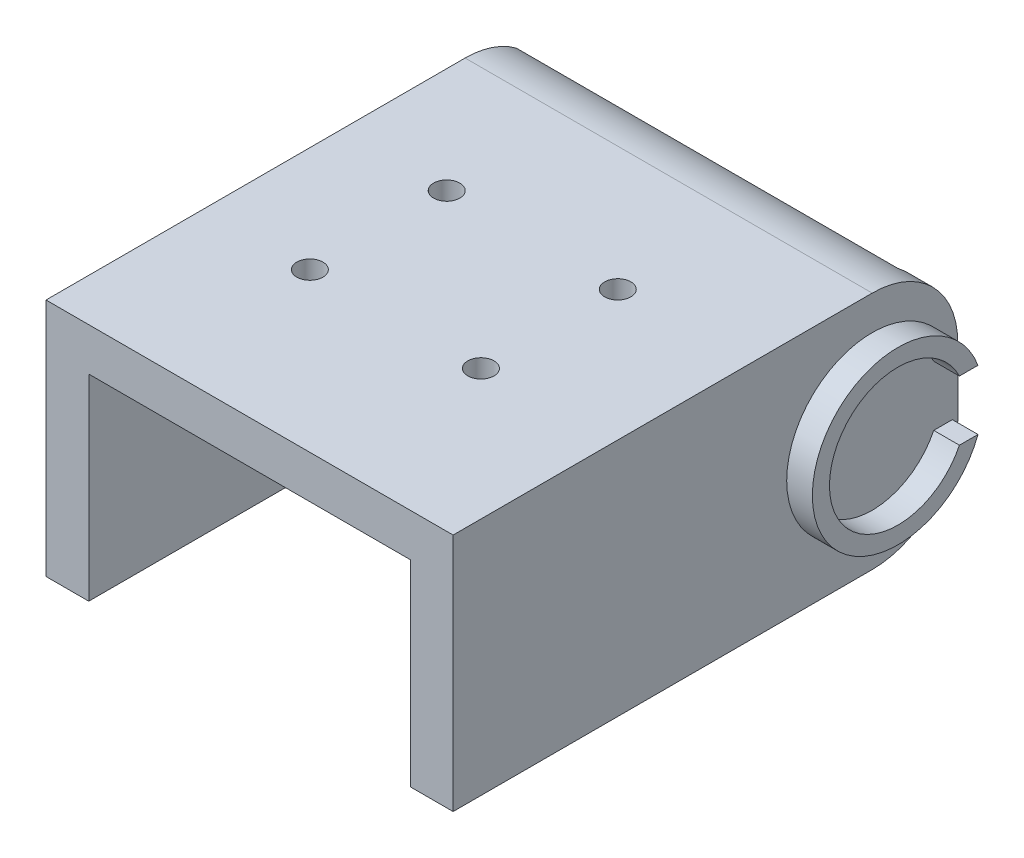
ISO-10303-21;
HEADER;
FILE_DESCRIPTION(('STEP AP214'),'2;1');
FILE_NAME('part.step','',(''),(''),'','','');
FILE_SCHEMA(('AUTOMOTIVE_DESIGN { 1 0 10303 214 1 1 1 1 }'));
ENDSEC;
DATA;
#1=APPLICATION_CONTEXT('core data for automotive mechanical design processes');
#2=APPLICATION_PROTOCOL_DEFINITION('international standard','automotive_design',2000,#1);
#3=PRODUCT_CONTEXT('',#1,'mechanical');
#4=PRODUCT('Part','Part','',(#3));
#5=PRODUCT_RELATED_PRODUCT_CATEGORY('part','',(#4));
#6=PRODUCT_DEFINITION_FORMATION('','',#4);
#7=PRODUCT_DEFINITION_CONTEXT('part definition',#1,'design');
#8=PRODUCT_DEFINITION('design','',#6,#7);
#9=PRODUCT_DEFINITION_SHAPE('','',#8);
#10=(LENGTH_UNIT() NAMED_UNIT(*) SI_UNIT(.MILLI.,.METRE.));
#11=(NAMED_UNIT(*) PLANE_ANGLE_UNIT() SI_UNIT($,.RADIAN.));
#12=(NAMED_UNIT(*) SI_UNIT($,.STERADIAN.) SOLID_ANGLE_UNIT());
#13=UNCERTAINTY_MEASURE_WITH_UNIT(LENGTH_MEASURE(1.E-05),#10,'distance_accuracy_value','');
#14=(GEOMETRIC_REPRESENTATION_CONTEXT(3) GLOBAL_UNCERTAINTY_ASSIGNED_CONTEXT((#13)) GLOBAL_UNIT_ASSIGNED_CONTEXT((#10,
#11,#12)) REPRESENTATION_CONTEXT('',''));
#15=CARTESIAN_POINT('',(0.,0.,0.));
#16=DIRECTION('',(0.,0.,1.));
#17=DIRECTION('',(1.,0.,0.));
#18=AXIS2_PLACEMENT_3D('',#15,#16,#17);
#19=CARTESIAN_POINT('',(67.6,0.,0.));
#20=DIRECTION('',(0.,0.,1.));
#21=DIRECTION('',(-1.,0.,0.));
#22=AXIS2_PLACEMENT_3D('',#19,#20,#21);
#23=PLANE('',#22);
#24=DIRECTION('',(0.,1.,0.));
#25=VECTOR('',#24,1.);
#26=CARTESIAN_POINT('',(40.8,0.,0.));
#27=LINE('',#26,#25);
#28=CARTESIAN_POINT('',(40.8,-4.,0.));
#29=VERTEX_POINT('',#28);
#30=CARTESIAN_POINT('',(40.8,-3.49999999999999,0.));
#31=VERTEX_POINT('',#30);
#32=EDGE_CURVE('E384',#29,#31,#27,.T.);
#33=ORIENTED_EDGE('',*,*,#32,.T.);
#34=DIRECTION('',(1.,0.,0.));
#35=VECTOR('',#34,1.);
#36=CARTESIAN_POINT('',(40.8,-3.49999999999999,0.));
#37=LINE('',#36,#35);
#38=CARTESIAN_POINT('',(43.8,-3.49999999999999,0.));
#39=VERTEX_POINT('',#38);
#40=EDGE_CURVE('E447',#31,#39,#37,.T.);
#41=ORIENTED_EDGE('',*,*,#40,.T.);
#42=DIRECTION('',(0.,1.,0.));
#43=VECTOR('',#42,1.);
#44=CARTESIAN_POINT('',(43.8,14.,0.));
#45=LINE('',#44,#43);
#46=CARTESIAN_POINT('',(43.8,3.50000000000001,0.));
#47=VERTEX_POINT('',#46);
#48=EDGE_CURVE('E503',#39,#47,#45,.T.);
#49=ORIENTED_EDGE('',*,*,#48,.T.);
#50=DIRECTION('',(1.,0.,0.));
#51=VECTOR('',#50,1.);
#52=CARTESIAN_POINT('',(40.8,3.50000000000001,0.));
#53=LINE('',#52,#51);
#54=CARTESIAN_POINT('',(40.8,3.50000000000001,0.));
#55=VERTEX_POINT('',#54);
#56=EDGE_CURVE('E437',#55,#47,#53,.T.);
#57=ORIENTED_EDGE('',*,*,#56,.F.);
#58=DIRECTION('',(0.,1.,0.));
#59=VECTOR('',#58,1.);
#60=CARTESIAN_POINT('',(40.8,0.,0.));
#61=LINE('',#60,#59);
#62=CARTESIAN_POINT('',(40.8,8.00000000000001,0.));
#63=VERTEX_POINT('',#62);
#64=EDGE_CURVE('E398',#55,#63,#61,.T.);
#65=ORIENTED_EDGE('',*,*,#64,.T.);
#66=DIRECTION('',(1.,0.,0.));
#67=VECTOR('',#66,1.);
#68=CARTESIAN_POINT('',(40.8,8.00000000000001,0.));
#69=LINE('',#68,#67);
#70=CARTESIAN_POINT('',(43.8,8.00000000000001,0.));
#71=VERTEX_POINT('',#70);
#72=EDGE_CURVE('E433',#63,#71,#69,.T.);
#73=ORIENTED_EDGE('',*,*,#72,.T.);
#74=CARTESIAN_POINT('',(43.8,12.,0.));
#75=VERTEX_POINT('',#74);
#76=EDGE_CURVE('E494',#71,#75,#45,.T.);
#77=ORIENTED_EDGE('',*,*,#76,.T.);
#78=DIRECTION('',(-1.,0.,0.));
#79=VECTOR('',#78,1.);
#80=CARTESIAN_POINT('',(88.4,12.,0.));
#81=LINE('',#80,#79);
#82=CARTESIAN_POINT('',(88.4,12.,0.));
#83=VERTEX_POINT('',#82);
#84=EDGE_CURVE('E550',#83,#75,#81,.T.);
#85=ORIENTED_EDGE('',*,*,#84,.F.);
#86=DIRECTION('',(0.,-1.,0.));
#87=VECTOR('',#86,1.);
#88=CARTESIAN_POINT('',(88.4,14.,0.));
#89=LINE('',#88,#87);
#90=CARTESIAN_POINT('',(88.4,-3.99999999999998,0.));
#91=VERTEX_POINT('',#90);
#92=EDGE_CURVE('E320',#83,#91,#89,.T.);
#93=ORIENTED_EDGE('',*,*,#92,.T.);
#94=DIRECTION('',(-1.,0.,0.));
#95=VECTOR('',#94,1.);
#96=CARTESIAN_POINT('',(67.6,-3.99999999999998,0.));
#97=LINE('',#96,#95);
#98=EDGE_CURVE('E554',#29,#91,#97,.F.);
#99=ORIENTED_EDGE('',*,*,#98,.F.);
#100=EDGE_LOOP('',(#33,#41,#49,#57,#65,#73,#77,#85,#93,#99));
#101=FACE_BOUND('',#100,.T.);
#102=ADVANCED_FACE('F49',(#101),#23,.F.);
#103=CARTESIAN_POINT('',(43.8,14.,55.));
#104=DIRECTION('',(1.,0.,0.));
#105=DIRECTION('',(0.,-1.,0.));
#106=AXIS2_PLACEMENT_3D('',#103,#104,#105);
#107=PLANE('',#106);
#108=CARTESIAN_POINT('',(43.8,0.,6.));
#109=DIRECTION('',(1.,0.,0.));
#110=DIRECTION('',(0.,1.,0.));
#111=AXIS2_PLACEMENT_3D('',#108,#109,#110);
#112=CIRCLE('',#111,2.);
#113=CARTESIAN_POINT('',(43.8,2.00000000000001,6.));
#114=VERTEX_POINT('',#113);
#115=EDGE_CURVE('E489',#114,#114,#112,.T.);
#116=ORIENTED_EDGE('',*,*,#115,.T.);
#117=EDGE_LOOP('',(#116));
#118=FACE_BOUND('',#117,.T.);
#119=CARTESIAN_POINT('',(43.8,0.,6.));
#120=DIRECTION('',(1.,0.,0.));
#121=DIRECTION('',(0.,1.,0.));
#122=AXIS2_PLACEMENT_3D('',#119,#120,#121);
#123=CIRCLE('',#122,6.65);
#124=CARTESIAN_POINT('',(43.8,3.50000000000001,0.345576952508767));
#125=VERTEX_POINT('',#124);
#126=CARTESIAN_POINT('',(43.8,-3.49999999999999,0.34557695250877));
#127=VERTEX_POINT('',#126);
#128=EDGE_CURVE('E415',#125,#127,#123,.T.);
#129=ORIENTED_EDGE('',*,*,#128,.F.);
#130=DIRECTION('',(0.,0.,-1.));
#131=VECTOR('',#130,1.);
#132=CARTESIAN_POINT('',(43.8,3.50000000000001,0.));
#133=LINE('',#132,#131);
#134=EDGE_CURVE('E419',#125,#47,#133,.T.);
#135=ORIENTED_EDGE('',*,*,#134,.T.);
#136=ORIENTED_EDGE('',*,*,#48,.F.);
#137=DIRECTION('',(0.,0.,-1.));
#138=VECTOR('',#137,1.);
#139=CARTESIAN_POINT('',(43.8,-3.49999999999999,0.));
#140=LINE('',#139,#138);
#141=EDGE_CURVE('E412',#127,#39,#140,.T.);
#142=ORIENTED_EDGE('',*,*,#141,.F.);
#143=EDGE_LOOP('',(#129,#135,#136,#142));
#144=FACE_BOUND('',#143,.T.);
#145=ADVANCED_FACE('F691',(#118,#144),#107,.F.);
#146=DIRECTION('',(0.,0.,-1.));
#147=VECTOR('',#146,1.);
#148=CARTESIAN_POINT('',(43.8,-14.,55.));
#149=LINE('',#148,#147);
#150=CARTESIAN_POINT('',(43.8,-14.,19.6013578747392));
#151=VERTEX_POINT('',#150);
#152=CARTESIAN_POINT('',(43.8,-14.,10.));
#153=VERTEX_POINT('',#152);
#154=EDGE_CURVE('E514',#151,#153,#149,.T.);
#155=ORIENTED_EDGE('',*,*,#154,.F.);
#156=DIRECTION('',(0.,1.,0.));
#157=VECTOR('',#156,1.);
#158=CARTESIAN_POINT('',(43.8,-14.,19.6013578747392));
#159=LINE('',#158,#157);
#160=CARTESIAN_POINT('',(43.8,-5.53669618417802,19.6013578747392));
#161=VERTEX_POINT('',#160);
#162=EDGE_CURVE('E471',#151,#161,#159,.T.);
#163=ORIENTED_EDGE('',*,*,#162,.T.);
#164=DIRECTION('',(0.,0.,1.));
#165=VECTOR('',#164,1.);
#166=CARTESIAN_POINT('',(43.8,-5.53669618417802,37.7174277893702));
#167=LINE('',#166,#165);
#168=CARTESIAN_POINT('',(43.8,-5.53669618417802,37.7174277893702));
#169=VERTEX_POINT('',#168);
#170=EDGE_CURVE('E456',#161,#169,#167,.T.);
#171=ORIENTED_EDGE('',*,*,#170,.T.);
#172=DIRECTION('',(0.,-1.,0.));
#173=VECTOR('',#172,1.);
#174=CARTESIAN_POINT('',(43.8,-14.,37.7174277893702));
#175=LINE('',#174,#173);
#176=CARTESIAN_POINT('',(43.8,-14.,37.7174277893702));
#177=VERTEX_POINT('',#176);
#178=EDGE_CURVE('E451',#169,#177,#175,.T.);
#179=ORIENTED_EDGE('',*,*,#178,.T.);
#180=CARTESIAN_POINT('',(43.8,-14.,55.));
#181=VERTEX_POINT('',#180);
#182=EDGE_CURVE('E518',#181,#177,#149,.T.);
#183=ORIENTED_EDGE('',*,*,#182,.F.);
#184=DIRECTION('',(0.,1.,0.));
#185=VECTOR('',#184,1.);
#186=CARTESIAN_POINT('',(43.8,14.,55.));
#187=LINE('',#186,#185);
#188=CARTESIAN_POINT('',(43.8,14.,55.));
#189=VERTEX_POINT('',#188);
#190=EDGE_CURVE('E498',#181,#189,#187,.T.);
#191=ORIENTED_EDGE('',*,*,#190,.T.);
#192=DIRECTION('',(0.,0.,-1.));
#193=VECTOR('',#192,1.);
#194=CARTESIAN_POINT('',(43.8,14.,55.));
#195=LINE('',#194,#193);
#196=CARTESIAN_POINT('',(43.8,14.,6.));
#197=VERTEX_POINT('',#196);
#198=EDGE_CURVE('E364',#189,#197,#195,.T.);
#199=ORIENTED_EDGE('',*,*,#198,.T.);
#200=CARTESIAN_POINT('',(43.8,4.,6.));
#201=DIRECTION('',(-1.,0.,0.));
#202=DIRECTION('',(0.,-1.,0.));
#203=AXIS2_PLACEMENT_3D('',#200,#201,#202);
#204=CIRCLE('',#203,10.);
#205=EDGE_CURVE('E535',#75,#197,#204,.F.);
#206=ORIENTED_EDGE('',*,*,#205,.F.);
#207=ORIENTED_EDGE('',*,*,#76,.F.);
#208=DIRECTION('',(0.,0.,-1.));
#209=VECTOR('',#208,1.);
#210=CARTESIAN_POINT('',(43.8,8.00000000000001,0.));
#211=LINE('',#210,#209);
#212=CARTESIAN_POINT('',(43.8,8.00000000000001,6.));
#213=VERTEX_POINT('',#212);
#214=EDGE_CURVE('E422',#213,#71,#211,.T.);
#215=ORIENTED_EDGE('',*,*,#214,.F.);
#216=CARTESIAN_POINT('',(43.8,0.,6.));
#217=DIRECTION('',(1.,0.,0.));
#218=DIRECTION('',(0.,1.,0.));
#219=AXIS2_PLACEMENT_3D('',#216,#217,#218);
#220=CIRCLE('',#219,8.);
#221=CARTESIAN_POINT('',(43.8,-7.99999999999999,6.));
#222=VERTEX_POINT('',#221);
#223=EDGE_CURVE('E385',#213,#222,#220,.T.);
#224=ORIENTED_EDGE('',*,*,#223,.T.);
#225=DIRECTION('',(0.,0.,-1.));
#226=VECTOR('',#225,1.);
#227=CARTESIAN_POINT('',(43.8,-7.99999999999999,0.));
#228=LINE('',#227,#226);
#229=CARTESIAN_POINT('',(43.8,-7.99999999999999,0.834848610088319));
#230=VERTEX_POINT('',#229);
#231=EDGE_CURVE('E379',#222,#230,#228,.T.);
#232=ORIENTED_EDGE('',*,*,#231,.T.);
#233=CARTESIAN_POINT('',(43.8,-4.,10.));
#234=DIRECTION('',(-1.,0.,0.));
#235=DIRECTION('',(0.,-1.,0.));
#236=AXIS2_PLACEMENT_3D('',#233,#234,#235);
#237=CIRCLE('',#236,10.);
#238=EDGE_CURVE('E539',#153,#230,#237,.F.);
#239=ORIENTED_EDGE('',*,*,#238,.F.);
#240=EDGE_LOOP('',(#155,#163,#171,#179,#183,#191,#199,#206,#207,#215,#224,#232,#239));
#241=FACE_BOUND('',#240,.T.);
#242=ADVANCED_FACE('F623',(#241),#107,.F.);
#243=CARTESIAN_POINT('',(91.4,14.,55.));
#244=DIRECTION('',(0.,-1.,0.));
#245=DIRECTION('',(0.,0.,-1.));
#246=AXIS2_PLACEMENT_3D('',#243,#244,#245);
#247=PLANE('',#246);
#248=CARTESIAN_POINT('',(76.1499999999999,14.,36.5));
#249=DIRECTION('',(0.,-1.,0.));
#250=DIRECTION('',(0.,0.,1.));
#251=AXIS2_PLACEMENT_3D('',#248,#249,#250);
#252=CIRCLE('',#251,1.53015016707913);
#253=CARTESIAN_POINT('',(76.1499999999999,14.,38.0301501670791));
#254=VERTEX_POINT('',#253);
#255=EDGE_CURVE('E304',#254,#254,#252,.T.);
#256=ORIENTED_EDGE('',*,*,#255,.T.);
#257=EDGE_LOOP('',(#256));
#258=FACE_BOUND('',#257,.T.);
#259=CARTESIAN_POINT('',(56.1499999999998,14.,36.5));
#260=DIRECTION('',(0.,-1.,0.));
#261=DIRECTION('',(0.,0.,1.));
#262=AXIS2_PLACEMENT_3D('',#259,#260,#261);
#263=CIRCLE('',#262,1.53015016707913);
#264=CARTESIAN_POINT('',(56.1499999999998,14.,38.0301501670791));
#265=VERTEX_POINT('',#264);
#266=EDGE_CURVE('E310',#265,#265,#263,.T.);
#267=ORIENTED_EDGE('',*,*,#266,.T.);
#268=EDGE_LOOP('',(#267));
#269=FACE_BOUND('',#268,.T.);
#270=CARTESIAN_POINT('',(56.15,14.,20.5));
#271=DIRECTION('',(0.,-1.,0.));
#272=DIRECTION('',(0.,0.,1.));
#273=AXIS2_PLACEMENT_3D('',#270,#271,#272);
#274=CIRCLE('',#273,1.53015016707913);
#275=CARTESIAN_POINT('',(56.15,14.,22.0301501670791));
#276=VERTEX_POINT('',#275);
#277=EDGE_CURVE('E305',#276,#276,#274,.T.);
#278=ORIENTED_EDGE('',*,*,#277,.T.);
#279=EDGE_LOOP('',(#278));
#280=FACE_BOUND('',#279,.T.);
#281=CARTESIAN_POINT('',(76.15,14.,20.5));
#282=DIRECTION('',(0.,-1.,0.));
#283=DIRECTION('',(0.,0.,1.));
#284=AXIS2_PLACEMENT_3D('',#281,#282,#283);
#285=CIRCLE('',#284,1.53015016707913);
#286=CARTESIAN_POINT('',(76.15,14.,22.0301501670791));
#287=VERTEX_POINT('',#286);
#288=EDGE_CURVE('E309',#287,#287,#285,.T.);
#289=ORIENTED_EDGE('',*,*,#288,.T.);
#290=EDGE_LOOP('',(#289));
#291=FACE_BOUND('',#290,.T.);
#292=ORIENTED_EDGE('',*,*,#198,.F.);
#293=DIRECTION('',(1.,0.,0.));
#294=VECTOR('',#293,1.);
#295=CARTESIAN_POINT('',(91.4,14.,55.));
#296=LINE('',#295,#294);
#297=CARTESIAN_POINT('',(91.4,14.,55.));
#298=VERTEX_POINT('',#297);
#299=EDGE_CURVE('E502',#189,#298,#296,.T.);
#300=ORIENTED_EDGE('',*,*,#299,.T.);
#301=DIRECTION('',(0.,0.,-1.));
#302=VECTOR('',#301,1.);
#303=CARTESIAN_POINT('',(91.4,14.,55.));
#304=LINE('',#303,#302);
#305=CARTESIAN_POINT('',(91.4,14.,6.));
#306=VERTEX_POINT('',#305);
#307=EDGE_CURVE('E526',#298,#306,#304,.T.);
#308=ORIENTED_EDGE('',*,*,#307,.T.);
#309=DIRECTION('',(-1.,0.,0.));
#310=VECTOR('',#309,1.);
#311=CARTESIAN_POINT('',(91.4,14.,6.));
#312=LINE('',#311,#310);
#313=EDGE_CURVE('E564',#197,#306,#312,.F.);
#314=ORIENTED_EDGE('',*,*,#313,.F.);
#315=EDGE_LOOP('',(#292,#300,#308,#314));
#316=FACE_BOUND('',#315,.T.);
#317=ADVANCED_FACE('F654',(#258,#269,#280,#291,#316),#247,.F.);
#318=CARTESIAN_POINT('',(91.4,14.,55.));
#319=DIRECTION('',(-1.,0.,0.));
#320=DIRECTION('',(0.,1.,0.));
#321=AXIS2_PLACEMENT_3D('',#318,#319,#320);
#322=PLANE('',#321);
#323=DIRECTION('',(0.,1.,0.));
#324=VECTOR('',#323,1.);
#325=CARTESIAN_POINT('',(91.4,14.,-4.));
#326=LINE('',#325,#324);
#327=CARTESIAN_POINT('',(91.4,-3.99999999999997,-4.));
#328=VERTEX_POINT('',#327);
#329=CARTESIAN_POINT('',(91.4,4.00000000000003,-4.));
#330=VERTEX_POINT('',#329);
#331=EDGE_CURVE('E321',#328,#330,#326,.T.);
#332=ORIENTED_EDGE('',*,*,#331,.T.);
#333=CARTESIAN_POINT('',(91.4,4.00000000000003,6.));
#334=DIRECTION('',(1.,0.,0.));
#335=DIRECTION('',(0.,1.,0.));
#336=AXIS2_PLACEMENT_3D('',#333,#334,#335);
#337=CIRCLE('',#336,10.);
#338=EDGE_CURVE('E568',#306,#330,#337,.F.);
#339=ORIENTED_EDGE('',*,*,#338,.F.);
#340=ORIENTED_EDGE('',*,*,#307,.F.);
#341=DIRECTION('',(0.,-1.,0.));
#342=VECTOR('',#341,1.);
#343=CARTESIAN_POINT('',(91.4,14.,55.));
#344=LINE('',#343,#342);
#345=CARTESIAN_POINT('',(91.4,-14.,55.));
#346=VERTEX_POINT('',#345);
#347=EDGE_CURVE('E507',#298,#346,#344,.T.);
#348=ORIENTED_EDGE('',*,*,#347,.T.);
#349=DIRECTION('',(0.,0.,-1.));
#350=VECTOR('',#349,1.);
#351=CARTESIAN_POINT('',(91.4,-14.,55.));
#352=LINE('',#351,#350);
#353=CARTESIAN_POINT('',(91.4,-14.,6.));
#354=VERTEX_POINT('',#353);
#355=EDGE_CURVE('E522',#346,#354,#352,.T.);
#356=ORIENTED_EDGE('',*,*,#355,.T.);
#357=CARTESIAN_POINT('',(91.4,-3.99999999999997,6.));
#358=DIRECTION('',(1.,0.,0.));
#359=DIRECTION('',(0.,1.,0.));
#360=AXIS2_PLACEMENT_3D('',#357,#358,#359);
#361=CIRCLE('',#360,10.);
#362=EDGE_CURVE('E578',#328,#354,#361,.F.);
#363=ORIENTED_EDGE('',*,*,#362,.F.);
#364=EDGE_LOOP('',(#332,#339,#340,#348,#356,#363));
#365=FACE_BOUND('',#364,.T.);
#366=CARTESIAN_POINT('',(91.4,0.,6.));
#367=DIRECTION('',(-1.,0.,0.));
#368=DIRECTION('',(0.,-1.,0.));
#369=AXIS2_PLACEMENT_3D('',#366,#367,#368);
#370=CIRCLE('',#369,10.);
#371=CARTESIAN_POINT('',(91.4,-3.49999999999997,-3.36749699759759));
#372=VERTEX_POINT('',#371);
#373=CARTESIAN_POINT('',(91.4,3.50000000000003,-3.36749699759759));
#374=VERTEX_POINT('',#373);
#375=EDGE_CURVE('E357',#372,#374,#370,.T.);
#376=ORIENTED_EDGE('',*,*,#375,.T.);
#377=DIRECTION('',(0.,0.,-1.));
#378=VECTOR('',#377,1.);
#379=CARTESIAN_POINT('',(91.4,3.50000000000003,0.));
#380=LINE('',#379,#378);
#381=CARTESIAN_POINT('',(91.4,3.50000000000003,-1.19374728496908));
#382=VERTEX_POINT('',#381);
#383=EDGE_CURVE('E340',#382,#374,#380,.T.);
#384=ORIENTED_EDGE('',*,*,#383,.F.);
#385=CARTESIAN_POINT('',(91.4,0.,6.));
#386=DIRECTION('',(-1.,0.,0.));
#387=DIRECTION('',(0.,-1.,0.));
#388=AXIS2_PLACEMENT_3D('',#385,#386,#387);
#389=CIRCLE('',#388,8.);
#390=CARTESIAN_POINT('',(91.4,-3.49999999999997,-1.19374728496908));
#391=VERTEX_POINT('',#390);
#392=EDGE_CURVE('E352',#391,#382,#389,.T.);
#393=ORIENTED_EDGE('',*,*,#392,.F.);
#394=DIRECTION('',(0.,0.,-1.));
#395=VECTOR('',#394,1.);
#396=CARTESIAN_POINT('',(91.4,-3.49999999999997,0.));
#397=LINE('',#396,#395);
#398=EDGE_CURVE('E334',#391,#372,#397,.T.);
#399=ORIENTED_EDGE('',*,*,#398,.T.);
#400=EDGE_LOOP('',(#376,#384,#393,#399));
#401=FACE_BOUND('',#400,.T.);
#402=ADVANCED_FACE('F605',(#365,#401),#322,.F.);
#403=CARTESIAN_POINT('',(91.4,-14.,55.));
#404=DIRECTION('',(0.,1.,0.));
#405=DIRECTION('',(0.,0.,1.));
#406=AXIS2_PLACEMENT_3D('',#403,#404,#405);
#407=PLANE('',#406);
#408=DIRECTION('',(-1.,0.,0.));
#409=VECTOR('',#408,1.);
#410=CARTESIAN_POINT('',(86.4,-14.,15.));
#411=LINE('',#410,#409);
#412=CARTESIAN_POINT('',(86.4,-14.,15.));
#413=VERTEX_POINT('',#412);
#414=CARTESIAN_POINT('',(48.8,-14.,15.));
#415=VERTEX_POINT('',#414);
#416=EDGE_CURVE('E255',#413,#415,#411,.T.);
#417=ORIENTED_EDGE('',*,*,#416,.T.);
#418=DIRECTION('',(0.,0.,1.));
#419=VECTOR('',#418,1.);
#420=CARTESIAN_POINT('',(48.8,-14.,15.));
#421=LINE('',#420,#419);
#422=CARTESIAN_POINT('',(48.8,-14.,55.));
#423=VERTEX_POINT('',#422);
#424=EDGE_CURVE('E265',#415,#423,#421,.T.);
#425=ORIENTED_EDGE('',*,*,#424,.T.);
#426=DIRECTION('',(-1.,0.,0.));
#427=VECTOR('',#426,1.);
#428=CARTESIAN_POINT('',(91.4,-14.,55.));
#429=LINE('',#428,#427);
#430=EDGE_CURVE('E511',#423,#181,#429,.T.);
#431=ORIENTED_EDGE('',*,*,#430,.T.);
#432=ORIENTED_EDGE('',*,*,#182,.T.);
#433=DIRECTION('',(1.,0.,0.));
#434=VECTOR('',#433,1.);
#435=CARTESIAN_POINT('',(38.8,-14.,37.7174277893702));
#436=LINE('',#435,#434);
#437=CARTESIAN_POINT('',(38.8,-14.,37.7174277893702));
#438=VERTEX_POINT('',#437);
#439=EDGE_CURVE('E486',#438,#177,#436,.T.);
#440=ORIENTED_EDGE('',*,*,#439,.F.);
#441=DIRECTION('',(0.,0.,-1.));
#442=VECTOR('',#441,1.);
#443=CARTESIAN_POINT('',(38.8,-14.,37.7174277893702));
#444=LINE('',#443,#442);
#445=CARTESIAN_POINT('',(38.8,-14.,19.6013578747392));
#446=VERTEX_POINT('',#445);
#447=EDGE_CURVE('E455',#438,#446,#444,.T.);
#448=ORIENTED_EDGE('',*,*,#447,.T.);
#449=DIRECTION('',(1.,0.,0.));
#450=VECTOR('',#449,1.);
#451=CARTESIAN_POINT('',(38.8,-14.,19.6013578747392));
#452=LINE('',#451,#450);
#453=EDGE_CURVE('E483',#446,#151,#452,.T.);
#454=ORIENTED_EDGE('',*,*,#453,.T.);
#455=ORIENTED_EDGE('',*,*,#154,.T.);
#456=DIRECTION('',(-1.,0.,0.));
#457=VECTOR('',#456,1.);
#458=CARTESIAN_POINT('',(91.4,-14.,10.));
#459=LINE('',#458,#457);
#460=CARTESIAN_POINT('',(88.4,-14.,10.));
#461=VERTEX_POINT('',#460);
#462=EDGE_CURVE('E356',#461,#153,#459,.T.);
#463=ORIENTED_EDGE('',*,*,#462,.F.);
#464=DIRECTION('',(0.,0.,1.));
#465=VECTOR('',#464,1.);
#466=CARTESIAN_POINT('',(88.4,-14.,-4.));
#467=LINE('',#466,#465);
#468=CARTESIAN_POINT('',(88.4,-14.,6.));
#469=VERTEX_POINT('',#468);
#470=EDGE_CURVE('E328',#469,#461,#467,.T.);
#471=ORIENTED_EDGE('',*,*,#470,.F.);
#472=DIRECTION('',(1.,0.,0.));
#473=VECTOR('',#472,1.);
#474=CARTESIAN_POINT('',(91.4,-14.,6.));
#475=LINE('',#474,#473);
#476=EDGE_CURVE('E59',#354,#469,#475,.F.);
#477=ORIENTED_EDGE('',*,*,#476,.F.);
#478=ORIENTED_EDGE('',*,*,#355,.F.);
#479=CARTESIAN_POINT('',(86.4,-14.,55.));
#480=VERTEX_POINT('',#479);
#481=EDGE_CURVE('E263',#346,#480,#429,.T.);
#482=ORIENTED_EDGE('',*,*,#481,.T.);
#483=DIRECTION('',(0.,0.,1.));
#484=VECTOR('',#483,1.);
#485=CARTESIAN_POINT('',(86.4,-14.,15.));
#486=LINE('',#485,#484);
#487=EDGE_CURVE('E247',#413,#480,#486,.T.);
#488=ORIENTED_EDGE('',*,*,#487,.F.);
#489=EDGE_LOOP('',(#417,#425,#431,#432,#440,#448,#454,#455,#463,#471,#477,#478,#482,#488));
#490=FACE_BOUND('',#489,.T.);
#491=ADVANCED_FACE('F260',(#490),#407,.F.);
#492=CARTESIAN_POINT('',(67.6,0.,55.));
#493=DIRECTION('',(0.,0.,1.));
#494=DIRECTION('',(-1.,0.,0.));
#495=AXIS2_PLACEMENT_3D('',#492,#493,#494);
#496=PLANE('',#495);
#497=DIRECTION('',(0.,-1.,0.));
#498=VECTOR('',#497,1.);
#499=CARTESIAN_POINT('',(86.4,-14.,55.));
#500=LINE('',#499,#498);
#501=CARTESIAN_POINT('',(86.4,9.00000000000003,55.));
#502=VERTEX_POINT('',#501);
#503=EDGE_CURVE('E277',#502,#480,#500,.T.);
#504=ORIENTED_EDGE('',*,*,#503,.T.);
#505=ORIENTED_EDGE('',*,*,#481,.F.);
#506=ORIENTED_EDGE('',*,*,#347,.F.);
#507=ORIENTED_EDGE('',*,*,#299,.F.);
#508=ORIENTED_EDGE('',*,*,#190,.F.);
#509=ORIENTED_EDGE('',*,*,#430,.F.);
#510=DIRECTION('',(0.,1.,0.));
#511=VECTOR('',#510,1.);
#512=CARTESIAN_POINT('',(48.8,-14.,55.));
#513=LINE('',#512,#511);
#514=CARTESIAN_POINT('',(48.8,9.00000000000001,55.));
#515=VERTEX_POINT('',#514);
#516=EDGE_CURVE('E66',#423,#515,#513,.T.);
#517=ORIENTED_EDGE('',*,*,#516,.T.);
#518=DIRECTION('',(1.,0.,0.));
#519=VECTOR('',#518,1.);
#520=CARTESIAN_POINT('',(86.4,9.00000000000003,55.));
#521=LINE('',#520,#519);
#522=EDGE_CURVE('E256',#515,#502,#521,.T.);
#523=ORIENTED_EDGE('',*,*,#522,.T.);
#524=EDGE_LOOP('',(#504,#505,#506,#507,#508,#509,#517,#523));
#525=FACE_BOUND('',#524,.T.);
#526=ADVANCED_FACE('F609',(#525),#496,.T.);
#527=CARTESIAN_POINT('',(46.8,0.,6.));
#528=DIRECTION('',(-1.,0.,0.));
#529=DIRECTION('',(0.,1.,0.));
#530=AXIS2_PLACEMENT_3D('',#527,#528,#529);
#531=CYLINDRICAL_SURFACE('',#530,2.);
#532=CARTESIAN_POINT('',(46.8,0.,6.));
#533=DIRECTION('',(1.,0.,0.));
#534=DIRECTION('',(0.,1.,0.));
#535=AXIS2_PLACEMENT_3D('',#532,#533,#534);
#536=CIRCLE('',#535,2.);
#537=CARTESIAN_POINT('',(46.8,2.00000000000001,6.));
#538=VERTEX_POINT('',#537);
#539=EDGE_CURVE('E490',#538,#538,#536,.T.);
#540=ORIENTED_EDGE('',*,*,#539,.T.);
#541=EDGE_LOOP('',(#540));
#542=FACE_BOUND('',#541,.T.);
#543=ORIENTED_EDGE('',*,*,#115,.F.);
#544=EDGE_LOOP('',(#543));
#545=FACE_BOUND('',#544,.T.);
#546=ADVANCED_FACE('F924',(#542,#545),#531,.F.);
#547=CARTESIAN_POINT('',(46.8,0.,6.));
#548=DIRECTION('',(-1.,0.,0.));
#549=DIRECTION('',(0.,1.,0.));
#550=AXIS2_PLACEMENT_3D('',#547,#548,#549);
#551=PLANE('',#550);
#552=ORIENTED_EDGE('',*,*,#539,.F.);
#553=EDGE_LOOP('',(#552));
#554=FACE_BOUND('',#553,.T.);
#555=ADVANCED_FACE('F932',(#554),#551,.T.);
#556=CARTESIAN_POINT('',(38.8,-14.,37.7174277893702));
#557=DIRECTION('',(0.,0.,-1.));
#558=DIRECTION('',(1.,0.,0.));
#559=AXIS2_PLACEMENT_3D('',#556,#557,#558);
#560=PLANE('',#559);
#561=ORIENTED_EDGE('',*,*,#178,.F.);
#562=DIRECTION('',(1.,0.,0.));
#563=VECTOR('',#562,1.);
#564=CARTESIAN_POINT('',(38.8,-5.53669618417802,37.7174277893702));
#565=LINE('',#564,#563);
#566=CARTESIAN_POINT('',(38.8,-5.53669618417802,37.7174277893702));
#567=VERTEX_POINT('',#566);
#568=EDGE_CURVE('E467',#567,#169,#565,.T.);
#569=ORIENTED_EDGE('',*,*,#568,.F.);
#570=DIRECTION('',(0.,-1.,0.));
#571=VECTOR('',#570,1.);
#572=CARTESIAN_POINT('',(38.8,-14.,37.7174277893702));
#573=LINE('',#572,#571);
#574=EDGE_CURVE('E452',#567,#438,#573,.T.);
#575=ORIENTED_EDGE('',*,*,#574,.T.);
#576=ORIENTED_EDGE('',*,*,#439,.T.);
#577=EDGE_LOOP('',(#561,#569,#575,#576));
#578=FACE_BOUND('',#577,.T.);
#579=ADVANCED_FACE('F628',(#578),#560,.F.);
#580=CARTESIAN_POINT('',(38.8,-14.,19.6013578747392));
#581=DIRECTION('',(0.,0.,1.));
#582=DIRECTION('',(-1.,0.,0.));
#583=AXIS2_PLACEMENT_3D('',#580,#581,#582);
#584=PLANE('',#583);
#585=ORIENTED_EDGE('',*,*,#162,.F.);
#586=ORIENTED_EDGE('',*,*,#453,.F.);
#587=DIRECTION('',(0.,1.,0.));
#588=VECTOR('',#587,1.);
#589=CARTESIAN_POINT('',(38.8,-14.,19.6013578747392));
#590=LINE('',#589,#588);
#591=CARTESIAN_POINT('',(38.8,-5.53669618417802,19.6013578747392));
#592=VERTEX_POINT('',#591);
#593=EDGE_CURVE('E460',#446,#592,#590,.T.);
#594=ORIENTED_EDGE('',*,*,#593,.T.);
#595=DIRECTION('',(1.,0.,0.));
#596=VECTOR('',#595,1.);
#597=CARTESIAN_POINT('',(38.8,-5.53669618417802,19.6013578747392));
#598=LINE('',#597,#596);
#599=EDGE_CURVE('E480',#592,#161,#598,.T.);
#600=ORIENTED_EDGE('',*,*,#599,.T.);
#601=EDGE_LOOP('',(#585,#586,#594,#600));
#602=FACE_BOUND('',#601,.T.);
#603=ADVANCED_FACE('F637',(#602),#584,.F.);
#604=CARTESIAN_POINT('',(38.8,-5.53669618417802,37.7174277893702));
#605=DIRECTION('',(0.,-1.,0.));
#606=DIRECTION('',(-1.,0.,0.));
#607=AXIS2_PLACEMENT_3D('',#604,#605,#606);
#608=PLANE('',#607);
#609=ORIENTED_EDGE('',*,*,#170,.F.);
#610=ORIENTED_EDGE('',*,*,#599,.F.);
#611=DIRECTION('',(0.,0.,1.));
#612=VECTOR('',#611,1.);
#613=CARTESIAN_POINT('',(38.8,-5.53669618417802,37.7174277893702));
#614=LINE('',#613,#612);
#615=EDGE_CURVE('E464',#592,#567,#614,.T.);
#616=ORIENTED_EDGE('',*,*,#615,.T.);
#617=ORIENTED_EDGE('',*,*,#568,.T.);
#618=EDGE_LOOP('',(#609,#610,#616,#617));
#619=FACE_BOUND('',#618,.T.);
#620=ADVANCED_FACE('F955',(#619),#608,.F.);
#621=CARTESIAN_POINT('',(38.8,0.,0.));
#622=DIRECTION('',(1.,0.,0.));
#623=DIRECTION('',(0.,-1.,0.));
#624=AXIS2_PLACEMENT_3D('',#621,#622,#623);
#625=PLANE('',#624);
#626=ORIENTED_EDGE('',*,*,#574,.F.);
#627=ORIENTED_EDGE('',*,*,#615,.F.);
#628=ORIENTED_EDGE('',*,*,#593,.F.);
#629=ORIENTED_EDGE('',*,*,#447,.F.);
#630=EDGE_LOOP('',(#626,#627,#628,#629));
#631=FACE_BOUND('',#630,.T.);
#632=ADVANCED_FACE('F634',(#631),#625,.F.);
#633=CARTESIAN_POINT('',(40.8,-7.99999999999999,0.));
#634=DIRECTION('',(0.,1.,0.));
#635=DIRECTION('',(1.,0.,0.));
#636=AXIS2_PLACEMENT_3D('',#633,#634,#635);
#637=PLANE('',#636);
#638=ORIENTED_EDGE('',*,*,#231,.F.);
#639=DIRECTION('',(1.,0.,0.));
#640=VECTOR('',#639,1.);
#641=CARTESIAN_POINT('',(40.8,-7.99999999999999,6.));
#642=LINE('',#641,#640);
#643=CARTESIAN_POINT('',(40.8,-7.99999999999999,6.));
#644=VERTEX_POINT('',#643);
#645=EDGE_CURVE('E408',#644,#222,#642,.T.);
#646=ORIENTED_EDGE('',*,*,#645,.F.);
#647=DIRECTION('',(0.,0.,-1.));
#648=VECTOR('',#647,1.);
#649=CARTESIAN_POINT('',(40.8,-7.99999999999999,0.));
#650=LINE('',#649,#648);
#651=CARTESIAN_POINT('',(40.8,-7.99999999999999,0.834848610088319));
#652=VERTEX_POINT('',#651);
#653=EDGE_CURVE('E380',#644,#652,#650,.T.);
#654=ORIENTED_EDGE('',*,*,#653,.T.);
#655=DIRECTION('',(-1.,0.,0.));
#656=VECTOR('',#655,1.);
#657=CARTESIAN_POINT('',(43.8,-7.99999999999999,0.834848610088319));
#658=LINE('',#657,#656);
#659=EDGE_CURVE('E543',#230,#652,#658,.T.);
#660=ORIENTED_EDGE('',*,*,#659,.F.);
#661=EDGE_LOOP('',(#638,#646,#654,#660));
#662=FACE_BOUND('',#661,.T.);
#663=ADVANCED_FACE('F678',(#662),#637,.F.);
#664=CARTESIAN_POINT('',(40.8,-3.49999999999999,0.));
#665=DIRECTION('',(0.,1.,0.));
#666=DIRECTION('',(1.,0.,0.));
#667=AXIS2_PLACEMENT_3D('',#664,#665,#666);
#668=PLANE('',#667);
#669=ORIENTED_EDGE('',*,*,#141,.T.);
#670=ORIENTED_EDGE('',*,*,#40,.F.);
#671=DIRECTION('',(0.,0.,-1.));
#672=VECTOR('',#671,1.);
#673=CARTESIAN_POINT('',(40.8,-3.49999999999999,0.));
#674=LINE('',#673,#672);
#675=CARTESIAN_POINT('',(40.8,-3.49999999999999,0.34557695250877));
#676=VERTEX_POINT('',#675);
#677=EDGE_CURVE('E389',#676,#31,#674,.T.);
#678=ORIENTED_EDGE('',*,*,#677,.F.);
#679=DIRECTION('',(1.,0.,0.));
#680=VECTOR('',#679,1.);
#681=CARTESIAN_POINT('',(40.8,-3.49999999999999,0.34557695250877));
#682=LINE('',#681,#680);
#683=EDGE_CURVE('E444',#676,#127,#682,.T.);
#684=ORIENTED_EDGE('',*,*,#683,.T.);
#685=EDGE_LOOP('',(#669,#670,#678,#684));
#686=FACE_BOUND('',#685,.T.);
#687=ADVANCED_FACE('F686',(#686),#668,.T.);
#688=CARTESIAN_POINT('',(40.8,0.,6.));
#689=DIRECTION('',(1.,0.,0.));
#690=DIRECTION('',(0.,-1.,0.));
#691=AXIS2_PLACEMENT_3D('',#688,#689,#690);
#692=CYLINDRICAL_SURFACE('',#691,6.65);
#693=ORIENTED_EDGE('',*,*,#128,.T.);
#694=ORIENTED_EDGE('',*,*,#683,.F.);
#695=CARTESIAN_POINT('',(40.8,0.,6.));
#696=DIRECTION('',(1.,0.,0.));
#697=DIRECTION('',(0.,1.,0.));
#698=AXIS2_PLACEMENT_3D('',#695,#696,#697);
#699=CIRCLE('',#698,6.65);
#700=CARTESIAN_POINT('',(40.8,3.50000000000001,0.34557695250877));
#701=VERTEX_POINT('',#700);
#702=EDGE_CURVE('E392',#701,#676,#699,.T.);
#703=ORIENTED_EDGE('',*,*,#702,.F.);
#704=DIRECTION('',(1.,0.,0.));
#705=VECTOR('',#704,1.);
#706=CARTESIAN_POINT('',(40.8,3.50000000000001,0.34557695250877));
#707=LINE('',#706,#705);
#708=EDGE_CURVE('E441',#701,#125,#707,.T.);
#709=ORIENTED_EDGE('',*,*,#708,.T.);
#710=EDGE_LOOP('',(#693,#694,#703,#709));
#711=FACE_BOUND('',#710,.T.);
#712=ADVANCED_FACE('F698',(#711),#692,.F.);
#713=CARTESIAN_POINT('',(40.8,3.50000000000001,0.));
#714=DIRECTION('',(0.,1.,0.));
#715=DIRECTION('',(1.,0.,0.));
#716=AXIS2_PLACEMENT_3D('',#713,#714,#715);
#717=PLANE('',#716);
#718=ORIENTED_EDGE('',*,*,#134,.F.);
#719=ORIENTED_EDGE('',*,*,#708,.F.);
#720=DIRECTION('',(0.,0.,-1.));
#721=VECTOR('',#720,1.);
#722=CARTESIAN_POINT('',(40.8,3.50000000000001,0.));
#723=LINE('',#722,#721);
#724=EDGE_CURVE('E395',#701,#55,#723,.T.);
#725=ORIENTED_EDGE('',*,*,#724,.T.);
#726=ORIENTED_EDGE('',*,*,#56,.T.);
#727=EDGE_LOOP('',(#718,#719,#725,#726));
#728=FACE_BOUND('',#727,.T.);
#729=ADVANCED_FACE('F695',(#728),#717,.F.);
#730=CARTESIAN_POINT('',(40.8,8.00000000000001,0.));
#731=DIRECTION('',(0.,1.,0.));
#732=DIRECTION('',(1.,0.,0.));
#733=AXIS2_PLACEMENT_3D('',#730,#731,#732);
#734=PLANE('',#733);
#735=ORIENTED_EDGE('',*,*,#214,.T.);
#736=ORIENTED_EDGE('',*,*,#72,.F.);
#737=DIRECTION('',(0.,0.,-1.));
#738=VECTOR('',#737,1.);
#739=CARTESIAN_POINT('',(40.8,8.00000000000001,0.));
#740=LINE('',#739,#738);
#741=CARTESIAN_POINT('',(40.8,8.00000000000001,6.));
#742=VERTEX_POINT('',#741);
#743=EDGE_CURVE('E402',#742,#63,#740,.T.);
#744=ORIENTED_EDGE('',*,*,#743,.F.);
#745=DIRECTION('',(1.,0.,0.));
#746=VECTOR('',#745,1.);
#747=CARTESIAN_POINT('',(40.8,8.00000000000001,6.));
#748=LINE('',#747,#746);
#749=EDGE_CURVE('E430',#742,#213,#748,.T.);
#750=ORIENTED_EDGE('',*,*,#749,.T.);
#751=EDGE_LOOP('',(#735,#736,#744,#750));
#752=FACE_BOUND('',#751,.T.);
#753=ADVANCED_FACE('F670',(#752),#734,.T.);
#754=CARTESIAN_POINT('',(40.8,0.,6.));
#755=DIRECTION('',(1.,0.,0.));
#756=DIRECTION('',(0.,-1.,0.));
#757=AXIS2_PLACEMENT_3D('',#754,#755,#756);
#758=CYLINDRICAL_SURFACE('',#757,8.);
#759=ORIENTED_EDGE('',*,*,#223,.F.);
#760=ORIENTED_EDGE('',*,*,#749,.F.);
#761=CARTESIAN_POINT('',(40.8,0.,6.));
#762=DIRECTION('',(1.,0.,0.));
#763=DIRECTION('',(0.,1.,0.));
#764=AXIS2_PLACEMENT_3D('',#761,#762,#763);
#765=CIRCLE('',#764,8.);
#766=EDGE_CURVE('E405',#742,#644,#765,.T.);
#767=ORIENTED_EDGE('',*,*,#766,.T.);
#768=ORIENTED_EDGE('',*,*,#645,.T.);
#769=EDGE_LOOP('',(#759,#760,#767,#768));
#770=FACE_BOUND('',#769,.T.);
#771=ADVANCED_FACE('F674',(#770),#758,.T.);
#772=CARTESIAN_POINT('',(40.8,0.,0.));
#773=DIRECTION('',(-1.,0.,0.));
#774=DIRECTION('',(0.,1.,0.));
#775=AXIS2_PLACEMENT_3D('',#772,#773,#774);
#776=PLANE('',#775);
#777=ORIENTED_EDGE('',*,*,#653,.F.);
#778=ORIENTED_EDGE('',*,*,#766,.F.);
#779=ORIENTED_EDGE('',*,*,#743,.T.);
#780=ORIENTED_EDGE('',*,*,#64,.F.);
#781=ORIENTED_EDGE('',*,*,#724,.F.);
#782=ORIENTED_EDGE('',*,*,#702,.T.);
#783=ORIENTED_EDGE('',*,*,#677,.T.);
#784=ORIENTED_EDGE('',*,*,#32,.F.);
#785=CARTESIAN_POINT('',(40.8,-4.,10.));
#786=DIRECTION('',(1.,0.,0.));
#787=DIRECTION('',(0.,1.,0.));
#788=AXIS2_PLACEMENT_3D('',#785,#786,#787);
#789=CIRCLE('',#788,10.);
#790=EDGE_CURVE('E547',#652,#29,#789,.T.);
#791=ORIENTED_EDGE('',*,*,#790,.F.);
#792=EDGE_LOOP('',(#777,#778,#779,#780,#781,#782,#783,#784,#791));
#793=FACE_BOUND('',#792,.T.);
#794=ADVANCED_FACE('F681',(#793),#776,.T.);
#795=CARTESIAN_POINT('',(94.4,0.,6.));
#796=DIRECTION('',(-1.,0.,0.));
#797=DIRECTION('',(0.,1.,0.));
#798=AXIS2_PLACEMENT_3D('',#795,#796,#797);
#799=CYLINDRICAL_SURFACE('',#798,8.);
#800=ORIENTED_EDGE('',*,*,#392,.T.);
#801=DIRECTION('',(-1.,0.,0.));
#802=VECTOR('',#801,1.);
#803=CARTESIAN_POINT('',(94.4,3.50000000000003,-1.19374728496908));
#804=LINE('',#803,#802);
#805=CARTESIAN_POINT('',(94.4,3.50000000000003,-1.19374728496908));
#806=VERTEX_POINT('',#805);
#807=EDGE_CURVE('E351',#806,#382,#804,.T.);
#808=ORIENTED_EDGE('',*,*,#807,.F.);
#809=CARTESIAN_POINT('',(94.4,0.,6.));
#810=DIRECTION('',(-1.,0.,0.));
#811=DIRECTION('',(0.,-1.,0.));
#812=AXIS2_PLACEMENT_3D('',#809,#810,#811);
#813=CIRCLE('',#812,8.);
#814=CARTESIAN_POINT('',(94.4,-3.49999999999997,-1.19374728496908));
#815=VERTEX_POINT('',#814);
#816=EDGE_CURVE('E335',#815,#806,#813,.T.);
#817=ORIENTED_EDGE('',*,*,#816,.F.);
#818=DIRECTION('',(-1.,0.,0.));
#819=VECTOR('',#818,1.);
#820=CARTESIAN_POINT('',(94.4,-3.49999999999997,-1.19374728496908));
#821=LINE('',#820,#819);
#822=EDGE_CURVE('E376',#815,#391,#821,.T.);
#823=ORIENTED_EDGE('',*,*,#822,.T.);
#824=EDGE_LOOP('',(#800,#808,#817,#823));
#825=FACE_BOUND('',#824,.T.);
#826=ADVANCED_FACE('F762',(#825),#799,.F.);
#827=CARTESIAN_POINT('',(94.4,-3.49999999999997,0.));
#828=DIRECTION('',(0.,-1.,0.));
#829=DIRECTION('',(0.,0.,-1.));
#830=AXIS2_PLACEMENT_3D('',#827,#828,#829);
#831=PLANE('',#830);
#832=ORIENTED_EDGE('',*,*,#398,.F.);
#833=ORIENTED_EDGE('',*,*,#822,.F.);
#834=DIRECTION('',(0.,0.,-1.));
#835=VECTOR('',#834,1.);
#836=CARTESIAN_POINT('',(94.4,-3.49999999999997,0.));
#837=LINE('',#836,#835);
#838=CARTESIAN_POINT('',(94.4,-3.49999999999997,-3.36749699759759));
#839=VERTEX_POINT('',#838);
#840=EDGE_CURVE('E339',#815,#839,#837,.T.);
#841=ORIENTED_EDGE('',*,*,#840,.T.);
#842=DIRECTION('',(-1.,0.,0.));
#843=VECTOR('',#842,1.);
#844=CARTESIAN_POINT('',(94.4,-3.49999999999997,-3.36749699759759));
#845=LINE('',#844,#843);
#846=EDGE_CURVE('E373',#839,#372,#845,.T.);
#847=ORIENTED_EDGE('',*,*,#846,.T.);
#848=EDGE_LOOP('',(#832,#833,#841,#847));
#849=FACE_BOUND('',#848,.T.);
#850=ADVANCED_FACE('F758',(#849),#831,.F.);
#851=CARTESIAN_POINT('',(94.4,0.,6.));
#852=DIRECTION('',(-1.,0.,0.));
#853=DIRECTION('',(0.,1.,0.));
#854=AXIS2_PLACEMENT_3D('',#851,#852,#853);
#855=CYLINDRICAL_SURFACE('',#854,10.);
#856=ORIENTED_EDGE('',*,*,#846,.F.);
#857=CARTESIAN_POINT('',(94.4,0.,6.));
#858=DIRECTION('',(-1.,0.,0.));
#859=DIRECTION('',(0.,-1.,0.));
#860=AXIS2_PLACEMENT_3D('',#857,#858,#859);
#861=CIRCLE('',#860,10.);
#862=CARTESIAN_POINT('',(94.4,3.50000000000003,-3.36749699759759));
#863=VERTEX_POINT('',#862);
#864=EDGE_CURVE('E344',#839,#863,#861,.T.);
#865=ORIENTED_EDGE('',*,*,#864,.T.);
#866=DIRECTION('',(-1.,0.,0.));
#867=VECTOR('',#866,1.);
#868=CARTESIAN_POINT('',(94.4,3.50000000000003,-3.36749699759759));
#869=LINE('',#868,#867);
#870=EDGE_CURVE('E370',#863,#374,#869,.T.);
#871=ORIENTED_EDGE('',*,*,#870,.T.);
#872=ORIENTED_EDGE('',*,*,#375,.F.);
#873=EDGE_LOOP('',(#856,#865,#871,#872));
#874=FACE_BOUND('',#873,.T.);
#875=ADVANCED_FACE('F754',(#874),#855,.T.);
#876=CARTESIAN_POINT('',(94.4,3.50000000000003,0.));
#877=DIRECTION('',(0.,-1.,0.));
#878=DIRECTION('',(-1.,0.,0.));
#879=AXIS2_PLACEMENT_3D('',#876,#877,#878);
#880=PLANE('',#879);
#881=ORIENTED_EDGE('',*,*,#383,.T.);
#882=ORIENTED_EDGE('',*,*,#870,.F.);
#883=DIRECTION('',(0.,0.,-1.));
#884=VECTOR('',#883,1.);
#885=CARTESIAN_POINT('',(94.4,3.50000000000003,0.));
#886=LINE('',#885,#884);
#887=EDGE_CURVE('E348',#806,#863,#886,.T.);
#888=ORIENTED_EDGE('',*,*,#887,.F.);
#889=ORIENTED_EDGE('',*,*,#807,.T.);
#890=EDGE_LOOP('',(#881,#882,#888,#889));
#891=FACE_BOUND('',#890,.T.);
#892=ADVANCED_FACE('F750',(#891),#880,.T.);
#893=CARTESIAN_POINT('',(94.4,0.,0.));
#894=DIRECTION('',(1.,0.,0.));
#895=DIRECTION('',(0.,-1.,0.));
#896=AXIS2_PLACEMENT_3D('',#893,#894,#895);
#897=PLANE('',#896);
#898=ORIENTED_EDGE('',*,*,#816,.T.);
#899=ORIENTED_EDGE('',*,*,#887,.T.);
#900=ORIENTED_EDGE('',*,*,#864,.F.);
#901=ORIENTED_EDGE('',*,*,#840,.F.);
#902=EDGE_LOOP('',(#898,#899,#900,#901));
#903=FACE_BOUND('',#902,.T.);
#904=ADVANCED_FACE('F747',(#903),#897,.T.);
#905=CARTESIAN_POINT('',(88.4,14.,-4.));
#906=DIRECTION('',(1.,0.,0.));
#907=DIRECTION('',(0.,-1.,0.));
#908=AXIS2_PLACEMENT_3D('',#905,#906,#907);
#909=PLANE('',#908);
#910=ORIENTED_EDGE('',*,*,#470,.T.);
#911=CARTESIAN_POINT('',(88.4,-3.99999999999997,10.));
#912=DIRECTION('',(-1.,0.,0.));
#913=DIRECTION('',(0.,-1.,0.));
#914=AXIS2_PLACEMENT_3D('',#911,#912,#913);
#915=CIRCLE('',#914,10.);
#916=EDGE_CURVE('E572',#91,#461,#915,.T.);
#917=ORIENTED_EDGE('',*,*,#916,.F.);
#918=ORIENTED_EDGE('',*,*,#92,.F.);
#919=CARTESIAN_POINT('',(88.4,4.00000000000003,6.));
#920=DIRECTION('',(-1.,0.,0.));
#921=DIRECTION('',(0.,-1.,0.));
#922=AXIS2_PLACEMENT_3D('',#919,#920,#921);
#923=CIRCLE('',#922,10.);
#924=CARTESIAN_POINT('',(88.4,4.00000000000003,-4.));
#925=VERTEX_POINT('',#924);
#926=EDGE_CURVE('E561',#925,#83,#923,.F.);
#927=ORIENTED_EDGE('',*,*,#926,.F.);
#928=DIRECTION('',(0.,-1.,0.));
#929=VECTOR('',#928,1.);
#930=CARTESIAN_POINT('',(88.4,14.,-4.));
#931=LINE('',#930,#929);
#932=CARTESIAN_POINT('',(88.4,-3.99999999999998,-4.));
#933=VERTEX_POINT('',#932);
#934=EDGE_CURVE('E325',#925,#933,#931,.T.);
#935=ORIENTED_EDGE('',*,*,#934,.T.);
#936=CARTESIAN_POINT('',(88.4,-3.99999999999997,6.));
#937=DIRECTION('',(-1.,0.,0.));
#938=DIRECTION('',(0.,-1.,0.));
#939=AXIS2_PLACEMENT_3D('',#936,#937,#938);
#940=CIRCLE('',#939,10.);
#941=EDGE_CURVE('E11',#469,#933,#940,.F.);
#942=ORIENTED_EDGE('',*,*,#941,.F.);
#943=EDGE_LOOP('',(#910,#917,#918,#927,#935,#942));
#944=FACE_BOUND('',#943,.T.);
#945=ADVANCED_FACE('F588',(#944),#909,.F.);
#946=CARTESIAN_POINT('',(67.6,0.,-4.));
#947=DIRECTION('',(0.,0.,1.));
#948=DIRECTION('',(-1.,0.,0.));
#949=AXIS2_PLACEMENT_3D('',#946,#947,#948);
#950=PLANE('',#949);
#951=ORIENTED_EDGE('',*,*,#934,.F.);
#952=DIRECTION('',(-1.,0.,0.));
#953=VECTOR('',#952,1.);
#954=CARTESIAN_POINT('',(67.6,4.00000000000002,-4.));
#955=LINE('',#954,#953);
#956=EDGE_CURVE('E558',#330,#925,#955,.T.);
#957=ORIENTED_EDGE('',*,*,#956,.F.);
#958=ORIENTED_EDGE('',*,*,#331,.F.);
#959=DIRECTION('',(1.,0.,0.));
#960=VECTOR('',#959,1.);
#961=CARTESIAN_POINT('',(67.6,-3.99999999999998,-4.));
#962=LINE('',#961,#960);
#963=EDGE_CURVE('E575',#933,#328,#962,.T.);
#964=ORIENTED_EDGE('',*,*,#963,.F.);
#965=EDGE_LOOP('',(#951,#957,#958,#964));
#966=FACE_BOUND('',#965,.T.);
#967=ADVANCED_FACE('F602',(#966),#950,.F.);
#968=CARTESIAN_POINT('',(91.4,-3.99999999999997,10.));
#969=DIRECTION('',(-1.,0.,0.));
#970=DIRECTION('',(0.,0.,-1.));
#971=AXIS2_PLACEMENT_3D('',#968,#969,#970);
#972=CYLINDRICAL_SURFACE('',#971,10.);
#973=ORIENTED_EDGE('',*,*,#916,.T.);
#974=ORIENTED_EDGE('',*,*,#462,.T.);
#975=ORIENTED_EDGE('',*,*,#238,.T.);
#976=ORIENTED_EDGE('',*,*,#659,.T.);
#977=ORIENTED_EDGE('',*,*,#790,.T.);
#978=ORIENTED_EDGE('',*,*,#98,.T.);
#979=EDGE_LOOP('',(#973,#974,#975,#976,#977,#978));
#980=FACE_BOUND('',#979,.T.);
#981=ADVANCED_FACE('F594',(#980),#972,.T.);
#982=CARTESIAN_POINT('',(67.6,4.00000000000002,6.));
#983=DIRECTION('',(-1.,0.,0.));
#984=DIRECTION('',(0.,0.,-1.));
#985=AXIS2_PLACEMENT_3D('',#982,#983,#984);
#986=CYLINDRICAL_SURFACE('',#985,10.);
#987=ORIENTED_EDGE('',*,*,#338,.T.);
#988=ORIENTED_EDGE('',*,*,#956,.T.);
#989=ORIENTED_EDGE('',*,*,#926,.T.);
#990=ORIENTED_EDGE('',*,*,#84,.T.);
#991=ORIENTED_EDGE('',*,*,#205,.T.);
#992=ORIENTED_EDGE('',*,*,#313,.T.);
#993=EDGE_LOOP('',(#987,#988,#989,#990,#991,#992));
#994=FACE_BOUND('',#993,.T.);
#995=ADVANCED_FACE('F599',(#994),#986,.T.);
#996=CARTESIAN_POINT('',(67.6,-3.99999999999998,6.));
#997=DIRECTION('',(1.,0.,0.));
#998=DIRECTION('',(0.,0.,1.));
#999=AXIS2_PLACEMENT_3D('',#996,#997,#998);
#1000=CYLINDRICAL_SURFACE('',#999,10.);
#1001=ORIENTED_EDGE('',*,*,#941,.T.);
#1002=ORIENTED_EDGE('',*,*,#963,.T.);
#1003=ORIENTED_EDGE('',*,*,#362,.T.);
#1004=ORIENTED_EDGE('',*,*,#476,.T.);
#1005=EDGE_LOOP('',(#1001,#1002,#1003,#1004));
#1006=FACE_BOUND('',#1005,.T.);
#1007=ADVANCED_FACE('F51',(#1006),#1000,.T.);
#1008=CARTESIAN_POINT('',(76.15,-14.,20.5));
#1009=DIRECTION('',(0.,1.,0.));
#1010=DIRECTION('',(0.,0.,1.));
#1011=AXIS2_PLACEMENT_3D('',#1008,#1009,#1010);
#1012=CYLINDRICAL_SURFACE('',#1011,1.53015016707913);
#1013=CARTESIAN_POINT('',(76.15,9.00000000000002,20.5));
#1014=DIRECTION('',(0.,-1.,0.));
#1015=DIRECTION('',(0.,0.,1.));
#1016=AXIS2_PLACEMENT_3D('',#1013,#1014,#1015);
#1017=CIRCLE('',#1016,1.53015016707913);
#1018=CARTESIAN_POINT('',(76.15,9.00000000000002,22.0301501670791));
#1019=VERTEX_POINT('',#1018);
#1020=EDGE_CURVE('E300',#1019,#1019,#1017,.F.);
#1021=ORIENTED_EDGE('',*,*,#1020,.F.);
#1022=EDGE_LOOP('',(#1021));
#1023=FACE_BOUND('',#1022,.T.);
#1024=ORIENTED_EDGE('',*,*,#288,.F.);
#1025=EDGE_LOOP('',(#1024));
#1026=FACE_BOUND('',#1025,.T.);
#1027=ADVANCED_FACE('F727',(#1023,#1026),#1012,.F.);
#1028=CARTESIAN_POINT('',(56.15,-14.,20.5));
#1029=DIRECTION('',(0.,1.,0.));
#1030=DIRECTION('',(0.,0.,1.));
#1031=AXIS2_PLACEMENT_3D('',#1028,#1029,#1030);
#1032=CYLINDRICAL_SURFACE('',#1031,1.53015016707913);
#1033=CARTESIAN_POINT('',(56.15,9.00000000000001,20.5));
#1034=DIRECTION('',(0.,-1.,0.));
#1035=DIRECTION('',(0.,0.,1.));
#1036=AXIS2_PLACEMENT_3D('',#1033,#1034,#1035);
#1037=CIRCLE('',#1036,1.53015016707913);
#1038=CARTESIAN_POINT('',(56.15,9.00000000000001,22.0301501670791));
#1039=VERTEX_POINT('',#1038);
#1040=EDGE_CURVE('E296',#1039,#1039,#1037,.F.);
#1041=ORIENTED_EDGE('',*,*,#1040,.F.);
#1042=EDGE_LOOP('',(#1041));
#1043=FACE_BOUND('',#1042,.T.);
#1044=ORIENTED_EDGE('',*,*,#277,.F.);
#1045=EDGE_LOOP('',(#1044));
#1046=FACE_BOUND('',#1045,.T.);
#1047=ADVANCED_FACE('F731',(#1043,#1046),#1032,.F.);
#1048=CARTESIAN_POINT('',(56.1499999999999,-14.,36.5));
#1049=DIRECTION('',(0.,1.,0.));
#1050=DIRECTION('',(0.,0.,1.));
#1051=AXIS2_PLACEMENT_3D('',#1048,#1049,#1050);
#1052=CYLINDRICAL_SURFACE('',#1051,1.53015016707913);
#1053=CARTESIAN_POINT('',(56.1499999999998,9.00000000000001,36.5));
#1054=DIRECTION('',(0.,-1.,0.));
#1055=DIRECTION('',(0.,0.,1.));
#1056=AXIS2_PLACEMENT_3D('',#1053,#1054,#1055);
#1057=CIRCLE('',#1056,1.53015016707913);
#1058=CARTESIAN_POINT('',(56.1499999999998,9.00000000000001,38.0301501670791));
#1059=VERTEX_POINT('',#1058);
#1060=EDGE_CURVE('E292',#1059,#1059,#1057,.F.);
#1061=ORIENTED_EDGE('',*,*,#1060,.F.);
#1062=EDGE_LOOP('',(#1061));
#1063=FACE_BOUND('',#1062,.T.);
#1064=ORIENTED_EDGE('',*,*,#266,.F.);
#1065=EDGE_LOOP('',(#1064));
#1066=FACE_BOUND('',#1065,.T.);
#1067=ADVANCED_FACE('F650',(#1063,#1066),#1052,.F.);
#1068=CARTESIAN_POINT('',(76.1499999999999,-14.,36.5));
#1069=DIRECTION('',(0.,1.,0.));
#1070=DIRECTION('',(0.,0.,1.));
#1071=AXIS2_PLACEMENT_3D('',#1068,#1069,#1070);
#1072=CYLINDRICAL_SURFACE('',#1071,1.53015016707913);
#1073=CARTESIAN_POINT('',(76.1499999999999,9.00000000000002,36.5));
#1074=DIRECTION('',(0.,-1.,0.));
#1075=DIRECTION('',(0.,0.,1.));
#1076=AXIS2_PLACEMENT_3D('',#1073,#1074,#1075);
#1077=CIRCLE('',#1076,1.53015016707913);
#1078=CARTESIAN_POINT('',(76.1499999999999,9.00000000000002,38.0301501670791));
#1079=VERTEX_POINT('',#1078);
#1080=EDGE_CURVE('E53',#1079,#1079,#1077,.F.);
#1081=ORIENTED_EDGE('',*,*,#1080,.F.);
#1082=EDGE_LOOP('',(#1081));
#1083=FACE_BOUND('',#1082,.T.);
#1084=ORIENTED_EDGE('',*,*,#255,.F.);
#1085=EDGE_LOOP('',(#1084));
#1086=FACE_BOUND('',#1085,.T.);
#1087=ADVANCED_FACE('F647',(#1083,#1086),#1072,.F.);
#1088=CARTESIAN_POINT('',(86.4,9.00000000000003,15.));
#1089=DIRECTION('',(0.,1.,0.));
#1090=DIRECTION('',(0.,0.,1.));
#1091=AXIS2_PLACEMENT_3D('',#1088,#1089,#1090);
#1092=PLANE('',#1091);
#1093=ORIENTED_EDGE('',*,*,#1040,.T.);
#1094=EDGE_LOOP('',(#1093));
#1095=FACE_BOUND('',#1094,.T.);
#1096=ORIENTED_EDGE('',*,*,#1080,.T.);
#1097=EDGE_LOOP('',(#1096));
#1098=FACE_BOUND('',#1097,.T.);
#1099=ORIENTED_EDGE('',*,*,#522,.F.);
#1100=DIRECTION('',(0.,0.,1.));
#1101=VECTOR('',#1100,1.);
#1102=CARTESIAN_POINT('',(48.8,9.00000000000001,15.));
#1103=LINE('',#1102,#1101);
#1104=CARTESIAN_POINT('',(48.8,9.00000000000001,15.));
#1105=VERTEX_POINT('',#1104);
#1106=EDGE_CURVE('E287',#1105,#515,#1103,.T.);
#1107=ORIENTED_EDGE('',*,*,#1106,.F.);
#1108=DIRECTION('',(1.,0.,0.));
#1109=VECTOR('',#1108,1.);
#1110=CARTESIAN_POINT('',(86.4,9.00000000000003,15.));
#1111=LINE('',#1110,#1109);
#1112=CARTESIAN_POINT('',(86.4,9.00000000000003,15.));
#1113=VERTEX_POINT('',#1112);
#1114=EDGE_CURVE('E266',#1105,#1113,#1111,.T.);
#1115=ORIENTED_EDGE('',*,*,#1114,.T.);
#1116=DIRECTION('',(0.,0.,1.));
#1117=VECTOR('',#1116,1.);
#1118=CARTESIAN_POINT('',(86.4,9.00000000000003,15.));
#1119=LINE('',#1118,#1117);
#1120=EDGE_CURVE('E249',#1113,#502,#1119,.T.);
#1121=ORIENTED_EDGE('',*,*,#1120,.T.);
#1122=EDGE_LOOP('',(#1099,#1107,#1115,#1121));
#1123=FACE_BOUND('',#1122,.T.);
#1124=ORIENTED_EDGE('',*,*,#1060,.T.);
#1125=EDGE_LOOP('',(#1124));
#1126=FACE_BOUND('',#1125,.T.);
#1127=ORIENTED_EDGE('',*,*,#1020,.T.);
#1128=EDGE_LOOP('',(#1127));
#1129=FACE_BOUND('',#1128,.T.);
#1130=ADVANCED_FACE('F615',(#1095,#1098,#1123,#1126,#1129),#1092,.F.);
#1131=CARTESIAN_POINT('',(86.4,-14.,15.));
#1132=DIRECTION('',(1.,0.,0.));
#1133=DIRECTION('',(0.,0.,1.));
#1134=AXIS2_PLACEMENT_3D('',#1131,#1132,#1133);
#1135=PLANE('',#1134);
#1136=ORIENTED_EDGE('',*,*,#503,.F.);
#1137=ORIENTED_EDGE('',*,*,#1120,.F.);
#1138=DIRECTION('',(0.,-1.,0.));
#1139=VECTOR('',#1138,1.);
#1140=CARTESIAN_POINT('',(86.4,-14.,15.));
#1141=LINE('',#1140,#1139);
#1142=EDGE_CURVE('E243',#1113,#413,#1141,.T.);
#1143=ORIENTED_EDGE('',*,*,#1142,.T.);
#1144=ORIENTED_EDGE('',*,*,#487,.T.);
#1145=EDGE_LOOP('',(#1136,#1137,#1143,#1144));
#1146=FACE_BOUND('',#1145,.T.);
#1147=ADVANCED_FACE('F246',(#1146),#1135,.F.);
#1148=CARTESIAN_POINT('',(48.8,-14.,15.));
#1149=DIRECTION('',(-1.,0.,0.));
#1150=DIRECTION('',(0.,0.,-1.));
#1151=AXIS2_PLACEMENT_3D('',#1148,#1149,#1150);
#1152=PLANE('',#1151);
#1153=ORIENTED_EDGE('',*,*,#516,.F.);
#1154=ORIENTED_EDGE('',*,*,#424,.F.);
#1155=DIRECTION('',(0.,1.,0.));
#1156=VECTOR('',#1155,1.);
#1157=CARTESIAN_POINT('',(48.8,-14.,15.));
#1158=LINE('',#1157,#1156);
#1159=EDGE_CURVE('E269',#415,#1105,#1158,.T.);
#1160=ORIENTED_EDGE('',*,*,#1159,.T.);
#1161=ORIENTED_EDGE('',*,*,#1106,.T.);
#1162=EDGE_LOOP('',(#1153,#1154,#1160,#1161));
#1163=FACE_BOUND('',#1162,.T.);
#1164=ADVANCED_FACE('F617',(#1163),#1152,.F.);
#1165=CARTESIAN_POINT('',(67.6,0.,15.));
#1166=DIRECTION('',(0.,0.,-1.));
#1167=DIRECTION('',(1.,0.,0.));
#1168=AXIS2_PLACEMENT_3D('',#1165,#1166,#1167);
#1169=PLANE('',#1168);
#1170=ORIENTED_EDGE('',*,*,#1142,.F.);
#1171=ORIENTED_EDGE('',*,*,#1114,.F.);
#1172=ORIENTED_EDGE('',*,*,#1159,.F.);
#1173=ORIENTED_EDGE('',*,*,#416,.F.);
#1174=EDGE_LOOP('',(#1170,#1171,#1172,#1173));
#1175=FACE_BOUND('',#1174,.T.);
#1176=ADVANCED_FACE('F268',(#1175),#1169,.F.);
#1177=CLOSED_SHELL('',(#102,#145,#242,#317,#402,#491,#526,#546,#555,#579,#603,#620,#632,#663,
#687,#712,#729,#753,#771,#794,#826,#850,#875,#892,#904,#945,#967,#981,#995,#1007,#1027,#1047,
#1067,#1087,#1130,#1147,#1164,#1176));
#1178=MANIFOLD_SOLID_BREP('B2',#1177);
#1179=ADVANCED_BREP_SHAPE_REPRESENTATION('',(#18,#1178),#14);
#1180=SHAPE_DEFINITION_REPRESENTATION(#9,#1179);
ENDSEC;
END-ISO-10303-21;
